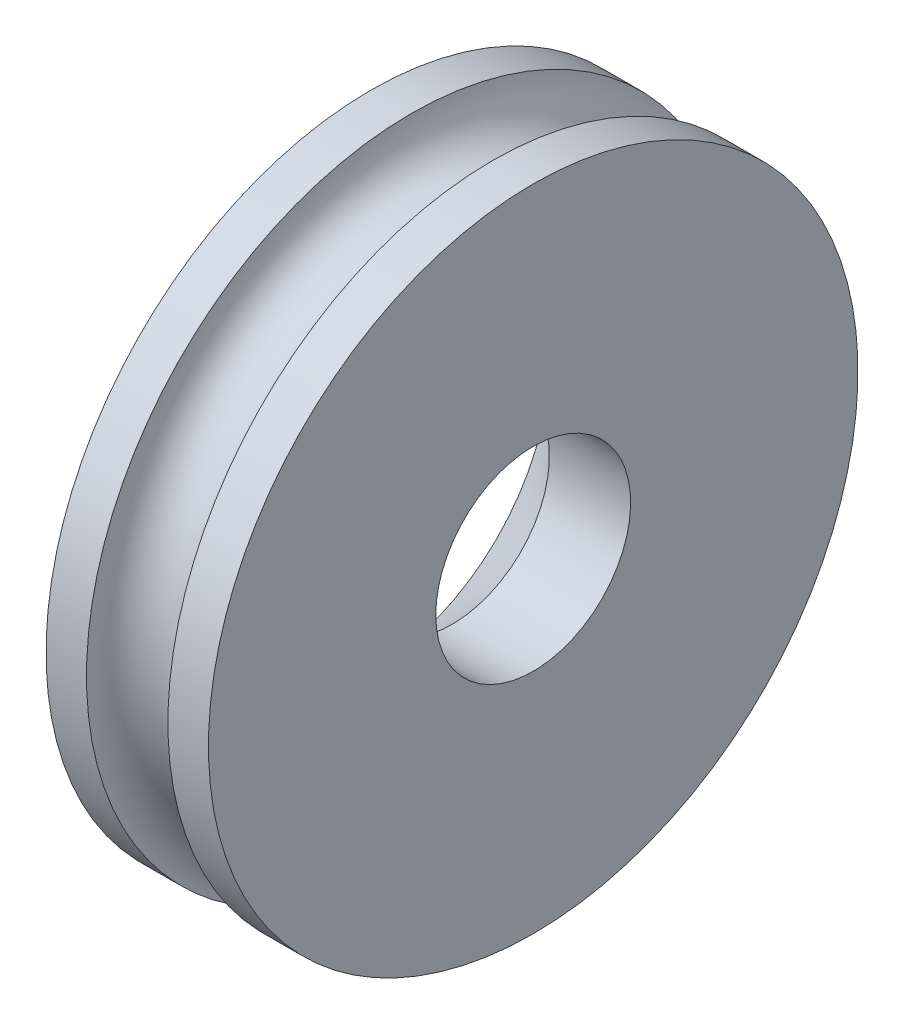
ISO-10303-21;
HEADER;
FILE_DESCRIPTION(('STEP AP214'),'2;1');
FILE_NAME('part.step','',(''),(''),'','','');
FILE_SCHEMA(('AUTOMOTIVE_DESIGN { 1 0 10303 214 1 1 1 1 }'));
ENDSEC;
DATA;
#1=APPLICATION_CONTEXT('core data for automotive mechanical design processes');
#2=APPLICATION_PROTOCOL_DEFINITION('international standard','automotive_design',2000,#1);
#3=PRODUCT_CONTEXT('',#1,'mechanical');
#4=PRODUCT('Part','Part','',(#3));
#5=PRODUCT_RELATED_PRODUCT_CATEGORY('part','',(#4));
#6=PRODUCT_DEFINITION_FORMATION('','',#4);
#7=PRODUCT_DEFINITION_CONTEXT('part definition',#1,'design');
#8=PRODUCT_DEFINITION('design','',#6,#7);
#9=PRODUCT_DEFINITION_SHAPE('','',#8);
#10=(LENGTH_UNIT() NAMED_UNIT(*) SI_UNIT(.MILLI.,.METRE.));
#11=(NAMED_UNIT(*) PLANE_ANGLE_UNIT() SI_UNIT($,.RADIAN.));
#12=(NAMED_UNIT(*) SI_UNIT($,.STERADIAN.) SOLID_ANGLE_UNIT());
#13=UNCERTAINTY_MEASURE_WITH_UNIT(LENGTH_MEASURE(1.E-05),#10,'distance_accuracy_value','');
#14=(GEOMETRIC_REPRESENTATION_CONTEXT(3) GLOBAL_UNCERTAINTY_ASSIGNED_CONTEXT((#13)) GLOBAL_UNIT_ASSIGNED_CONTEXT((#10,
#11,#12)) REPRESENTATION_CONTEXT('',''));
#15=CARTESIAN_POINT('',(0.,0.,0.));
#16=DIRECTION('',(0.,0.,1.));
#17=DIRECTION('',(1.,0.,0.));
#18=AXIS2_PLACEMENT_3D('',#15,#16,#17);
#19=CARTESIAN_POINT('',(-2.,0.,0.));
#20=DIRECTION('',(-1.,0.,0.));
#21=DIRECTION('',(0.,-1.,0.));
#22=AXIS2_PLACEMENT_3D('',#19,#20,#21);
#23=PLANE('',#22);
#24=CARTESIAN_POINT('',(-2.,0.,0.));
#25=DIRECTION('',(-1.,0.,0.));
#26=DIRECTION('',(0.,0.,1.));
#27=AXIS2_PLACEMENT_3D('',#24,#25,#26);
#28=CIRCLE('',#27,2.2);
#29=CARTESIAN_POINT('',(-2.,0.,2.2));
#30=VERTEX_POINT('',#29);
#31=EDGE_CURVE('E64',#30,#30,#28,.T.);
#32=ORIENTED_EDGE('',*,*,#31,.F.);
#33=EDGE_LOOP('',(#32));
#34=FACE_BOUND('',#33,.T.);
#35=CARTESIAN_POINT('',(-2.,0.,0.));
#36=DIRECTION('',(1.,0.,0.));
#37=DIRECTION('',(0.,1.,0.));
#38=AXIS2_PLACEMENT_3D('',#35,#36,#37);
#39=CIRCLE('',#38,4.);
#40=CARTESIAN_POINT('',(-2.,4.,0.));
#41=VERTEX_POINT('',#40);
#42=EDGE_CURVE('E10',#41,#41,#39,.T.);
#43=ORIENTED_EDGE('',*,*,#42,.F.);
#44=EDGE_LOOP('',(#43));
#45=FACE_BOUND('',#44,.T.);
#46=ADVANCED_FACE('F37',(#34,#45),#23,.T.);
#47=CARTESIAN_POINT('',(0.,0.,0.));
#48=DIRECTION('',(1.,0.,0.));
#49=DIRECTION('',(0.,1.,0.));
#50=AXIS2_PLACEMENT_3D('',#47,#48,#49);
#51=CYLINDRICAL_SURFACE('',#50,4.);
#52=ORIENTED_EDGE('',*,*,#42,.T.);
#53=EDGE_LOOP('',(#52));
#54=FACE_BOUND('',#53,.T.);
#55=CARTESIAN_POINT('',(-1.50204600608106,0.,0.));
#56=DIRECTION('',(1.,0.,0.));
#57=DIRECTION('',(0.,1.,0.));
#58=AXIS2_PLACEMENT_3D('',#55,#56,#57);
#59=CIRCLE('',#58,4.);
#60=CARTESIAN_POINT('',(-1.50204600608106,4.,0.));
#61=VERTEX_POINT('',#60);
#62=EDGE_CURVE('E45',#61,#61,#59,.T.);
#63=ORIENTED_EDGE('',*,*,#62,.F.);
#64=EDGE_LOOP('',(#63));
#65=FACE_BOUND('',#64,.T.);
#66=ADVANCED_FACE('F73',(#54,#65),#51,.T.);
#67=CARTESIAN_POINT('',(-1.00066251336806,0.,0.));
#68=DIRECTION('',(1.,0.,0.));
#69=DIRECTION('',(0.,1.,0.));
#70=AXIS2_PLACEMENT_3D('',#67,#68,#69);
#71=TOROIDAL_SURFACE('',#70,4.,0.501383492713003);
#72=ORIENTED_EDGE('',*,*,#62,.T.);
#73=EDGE_LOOP('',(#72));
#74=FACE_BOUND('',#73,.T.);
#75=CARTESIAN_POINT('',(-0.499279020655052,0.,0.));
#76=DIRECTION('',(1.,0.,0.));
#77=DIRECTION('',(0.,1.,0.));
#78=AXIS2_PLACEMENT_3D('',#75,#76,#77);
#79=CIRCLE('',#78,4.);
#80=CARTESIAN_POINT('',(-0.499279020655052,4.,0.));
#81=VERTEX_POINT('',#80);
#82=EDGE_CURVE('E50',#81,#81,#79,.T.);
#83=ORIENTED_EDGE('',*,*,#82,.F.);
#84=EDGE_LOOP('',(#83));
#85=FACE_BOUND('',#84,.T.);
#86=ADVANCED_FACE('F77',(#74,#85),#71,.F.);
#87=CARTESIAN_POINT('',(0.,0.,0.));
#88=DIRECTION('',(1.,0.,0.));
#89=DIRECTION('',(0.,1.,0.));
#90=AXIS2_PLACEMENT_3D('',#87,#88,#89);
#91=CYLINDRICAL_SURFACE('',#90,4.);
#92=ORIENTED_EDGE('',*,*,#82,.T.);
#93=EDGE_LOOP('',(#92));
#94=FACE_BOUND('',#93,.T.);
#95=CARTESIAN_POINT('',(0.,0.,0.));
#96=DIRECTION('',(1.,0.,0.));
#97=DIRECTION('',(0.,1.,0.));
#98=AXIS2_PLACEMENT_3D('',#95,#96,#97);
#99=CIRCLE('',#98,4.);
#100=CARTESIAN_POINT('',(0.,4.,0.));
#101=VERTEX_POINT('',#100);
#102=EDGE_CURVE('E56',#101,#101,#99,.T.);
#103=ORIENTED_EDGE('',*,*,#102,.F.);
#104=EDGE_LOOP('',(#103));
#105=FACE_BOUND('',#104,.T.);
#106=ADVANCED_FACE('F81',(#94,#105),#91,.T.);
#107=CARTESIAN_POINT('',(0.,0.,0.));
#108=DIRECTION('',(1.,0.,0.));
#109=DIRECTION('',(0.,1.,0.));
#110=AXIS2_PLACEMENT_3D('',#107,#108,#109);
#111=PLANE('',#110);
#112=CARTESIAN_POINT('',(0.,0.,0.));
#113=DIRECTION('',(1.,0.,0.));
#114=DIRECTION('',(0.,1.,0.));
#115=AXIS2_PLACEMENT_3D('',#112,#113,#114);
#116=CIRCLE('',#115,1.19999999999999);
#117=CARTESIAN_POINT('',(0.,1.19999999999999,0.));
#118=VERTEX_POINT('',#117);
#119=EDGE_CURVE('E40',#118,#118,#116,.T.);
#120=ORIENTED_EDGE('',*,*,#119,.F.);
#121=EDGE_LOOP('',(#120));
#122=FACE_BOUND('',#121,.T.);
#123=ORIENTED_EDGE('',*,*,#102,.T.);
#124=EDGE_LOOP('',(#123));
#125=FACE_BOUND('',#124,.T.);
#126=ADVANCED_FACE('F88',(#122,#125),#111,.T.);
#127=CARTESIAN_POINT('',(-2.,0.,0.));
#128=DIRECTION('',(-1.,0.,0.));
#129=DIRECTION('',(0.,0.,1.));
#130=AXIS2_PLACEMENT_3D('',#127,#128,#129);
#131=CYLINDRICAL_SURFACE('',#130,1.19999999999999);
#132=ORIENTED_EDGE('',*,*,#119,.T.);
#133=EDGE_LOOP('',(#132));
#134=FACE_BOUND('',#133,.T.);
#135=CARTESIAN_POINT('',(-0.999999999999999,0.,0.));
#136=DIRECTION('',(-1.,0.,0.));
#137=DIRECTION('',(0.,0.,1.));
#138=AXIS2_PLACEMENT_3D('',#135,#136,#137);
#139=CIRCLE('',#138,1.2);
#140=CARTESIAN_POINT('',(-0.999999999999999,0.,1.2));
#141=VERTEX_POINT('',#140);
#142=EDGE_CURVE('E60',#141,#141,#139,.T.);
#143=ORIENTED_EDGE('',*,*,#142,.T.);
#144=EDGE_LOOP('',(#143));
#145=FACE_BOUND('',#144,.T.);
#146=ADVANCED_FACE('F92',(#134,#145),#131,.F.);
#147=CARTESIAN_POINT('',(-2.,0.,0.));
#148=DIRECTION('',(-1.,0.,0.));
#149=DIRECTION('',(0.,0.,1.));
#150=AXIS2_PLACEMENT_3D('',#147,#148,#149);
#151=CONICAL_SURFACE('',#150,2.2,0.785398163397448);
#152=ORIENTED_EDGE('',*,*,#142,.F.);
#153=EDGE_LOOP('',(#152));
#154=FACE_BOUND('',#153,.T.);
#155=ORIENTED_EDGE('',*,*,#31,.T.);
#156=EDGE_LOOP('',(#155));
#157=FACE_BOUND('',#156,.T.);
#158=ADVANCED_FACE('F69',(#154,#157),#151,.F.);
#159=CLOSED_SHELL('',(#46,#66,#86,#106,#126,#146,#158));
#160=MANIFOLD_SOLID_BREP('B2',#159);
#161=ADVANCED_BREP_SHAPE_REPRESENTATION('',(#18,#160),#14);
#162=SHAPE_DEFINITION_REPRESENTATION(#9,#161);
ENDSEC;
END-ISO-10303-21;
